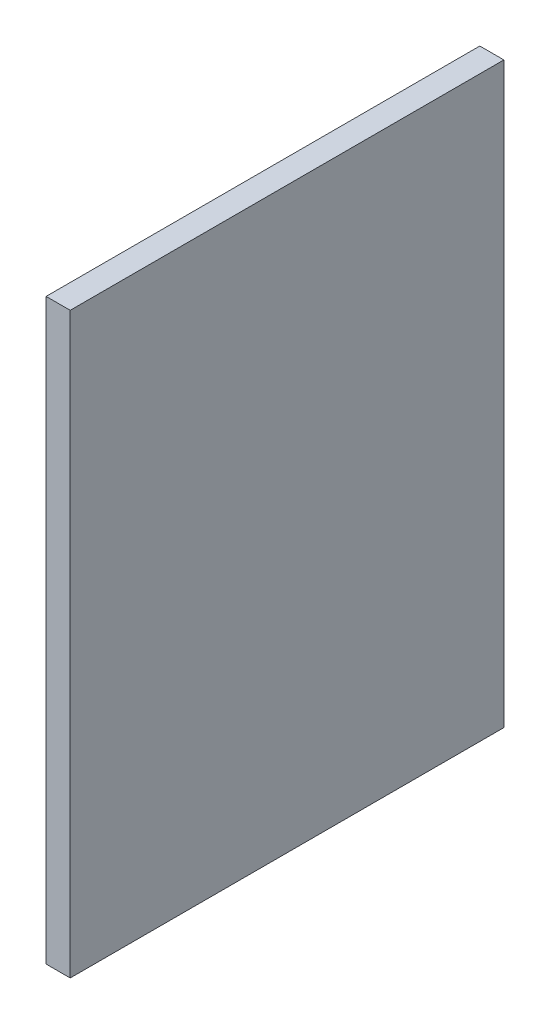
ISO-10303-21;
HEADER;
FILE_DESCRIPTION(('STEP AP214'),'2;1');
FILE_NAME('part.step','',(''),(''),'','','');
FILE_SCHEMA(('AUTOMOTIVE_DESIGN { 1 0 10303 214 1 1 1 1 }'));
ENDSEC;
DATA;
#1=APPLICATION_CONTEXT('core data for automotive mechanical design processes');
#2=APPLICATION_PROTOCOL_DEFINITION('international standard','automotive_design',2000,#1);
#3=PRODUCT_CONTEXT('',#1,'mechanical');
#4=PRODUCT('Part','Part','',(#3));
#5=PRODUCT_RELATED_PRODUCT_CATEGORY('part','',(#4));
#6=PRODUCT_DEFINITION_FORMATION('','',#4);
#7=PRODUCT_DEFINITION_CONTEXT('part definition',#1,'design');
#8=PRODUCT_DEFINITION('design','',#6,#7);
#9=PRODUCT_DEFINITION_SHAPE('','',#8);
#10=(LENGTH_UNIT() NAMED_UNIT(*) SI_UNIT(.MILLI.,.METRE.));
#11=(NAMED_UNIT(*) PLANE_ANGLE_UNIT() SI_UNIT($,.RADIAN.));
#12=(NAMED_UNIT(*) SI_UNIT($,.STERADIAN.) SOLID_ANGLE_UNIT());
#13=UNCERTAINTY_MEASURE_WITH_UNIT(LENGTH_MEASURE(1.E-05),#10,'distance_accuracy_value','');
#14=(GEOMETRIC_REPRESENTATION_CONTEXT(3) GLOBAL_UNCERTAINTY_ASSIGNED_CONTEXT((#13)) GLOBAL_UNIT_ASSIGNED_CONTEXT((#10,
#11,#12)) REPRESENTATION_CONTEXT('',''));
#15=CARTESIAN_POINT('',(0.,0.,0.));
#16=DIRECTION('',(0.,0.,1.));
#17=DIRECTION('',(1.,0.,0.));
#18=AXIS2_PLACEMENT_3D('',#15,#16,#17);
#19=CARTESIAN_POINT('',(1.5875,38.1,28.575));
#20=DIRECTION('',(0.,0.,-1.));
#21=DIRECTION('',(0.,1.,0.));
#22=AXIS2_PLACEMENT_3D('',#19,#20,#21);
#23=PLANE('',#22);
#24=DIRECTION('',(0.,-1.,0.));
#25=VECTOR('',#24,1.);
#26=CARTESIAN_POINT('',(-1.5875,38.1,28.575));
#27=LINE('',#26,#25);
#28=CARTESIAN_POINT('',(-1.5875,38.1,28.575));
#29=VERTEX_POINT('',#28);
#30=CARTESIAN_POINT('',(-1.5875,-38.1,28.575));
#31=VERTEX_POINT('',#30);
#32=EDGE_CURVE('E114',#29,#31,#27,.T.);
#33=ORIENTED_EDGE('',*,*,#32,.T.);
#34=DIRECTION('',(-1.,0.,0.));
#35=VECTOR('',#34,1.);
#36=CARTESIAN_POINT('',(1.5875,-38.1,28.575));
#37=LINE('',#36,#35);
#38=CARTESIAN_POINT('',(1.5875,-38.1,28.575));
#39=VERTEX_POINT('',#38);
#40=EDGE_CURVE('E11',#39,#31,#37,.T.);
#41=ORIENTED_EDGE('',*,*,#40,.F.);
#42=DIRECTION('',(0.,-1.,0.));
#43=VECTOR('',#42,1.);
#44=CARTESIAN_POINT('',(1.5875,38.1,28.575));
#45=LINE('',#44,#43);
#46=CARTESIAN_POINT('',(1.5875,38.1,28.575));
#47=VERTEX_POINT('',#46);
#48=EDGE_CURVE('E96',#47,#39,#45,.T.);
#49=ORIENTED_EDGE('',*,*,#48,.F.);
#50=DIRECTION('',(-1.,0.,0.));
#51=VECTOR('',#50,1.);
#52=CARTESIAN_POINT('',(1.5875,38.1,28.575));
#53=LINE('',#52,#51);
#54=EDGE_CURVE('E110',#47,#29,#53,.T.);
#55=ORIENTED_EDGE('',*,*,#54,.T.);
#56=EDGE_LOOP('',(#33,#41,#49,#55));
#57=FACE_BOUND('',#56,.T.);
#58=ADVANCED_FACE('F41',(#57),#23,.F.);
#59=CARTESIAN_POINT('',(1.5875,-38.1,-28.575));
#60=DIRECTION('',(0.,1.,0.));
#61=DIRECTION('',(0.,0.,1.));
#62=AXIS2_PLACEMENT_3D('',#59,#60,#61);
#63=PLANE('',#62);
#64=DIRECTION('',(0.,0.,-1.));
#65=VECTOR('',#64,1.);
#66=CARTESIAN_POINT('',(-1.5875,-38.1,-28.575));
#67=LINE('',#66,#65);
#68=CARTESIAN_POINT('',(-1.5875,-38.1,-28.575));
#69=VERTEX_POINT('',#68);
#70=EDGE_CURVE('E101',#31,#69,#67,.T.);
#71=ORIENTED_EDGE('',*,*,#70,.T.);
#72=DIRECTION('',(-1.,0.,0.));
#73=VECTOR('',#72,1.);
#74=CARTESIAN_POINT('',(1.5875,-38.1,-28.575));
#75=LINE('',#74,#73);
#76=CARTESIAN_POINT('',(1.5875,-38.1,-28.575));
#77=VERTEX_POINT('',#76);
#78=EDGE_CURVE('E49',#77,#69,#75,.T.);
#79=ORIENTED_EDGE('',*,*,#78,.F.);
#80=DIRECTION('',(0.,0.,-1.));
#81=VECTOR('',#80,1.);
#82=CARTESIAN_POINT('',(1.5875,-38.1,-28.575));
#83=LINE('',#82,#81);
#84=EDGE_CURVE('E90',#39,#77,#83,.T.);
#85=ORIENTED_EDGE('',*,*,#84,.F.);
#86=ORIENTED_EDGE('',*,*,#40,.T.);
#87=EDGE_LOOP('',(#71,#79,#85,#86));
#88=FACE_BOUND('',#87,.T.);
#89=ADVANCED_FACE('F100',(#88),#63,.F.);
#90=CARTESIAN_POINT('',(1.5875,38.1,-28.575));
#91=DIRECTION('',(0.,0.,1.));
#92=DIRECTION('',(0.,-1.,0.));
#93=AXIS2_PLACEMENT_3D('',#90,#91,#92);
#94=PLANE('',#93);
#95=DIRECTION('',(0.,1.,0.));
#96=VECTOR('',#95,1.);
#97=CARTESIAN_POINT('',(-1.5875,38.1,-28.575));
#98=LINE('',#97,#96);
#99=CARTESIAN_POINT('',(-1.5875,38.1,-28.575));
#100=VERTEX_POINT('',#99);
#101=EDGE_CURVE('E77',#69,#100,#98,.T.);
#102=ORIENTED_EDGE('',*,*,#101,.T.);
#103=DIRECTION('',(-1.,0.,0.));
#104=VECTOR('',#103,1.);
#105=CARTESIAN_POINT('',(1.5875,38.1,-28.575));
#106=LINE('',#105,#104);
#107=CARTESIAN_POINT('',(1.5875,38.1,-28.575));
#108=VERTEX_POINT('',#107);
#109=EDGE_CURVE('E103',#108,#100,#106,.T.);
#110=ORIENTED_EDGE('',*,*,#109,.F.);
#111=DIRECTION('',(0.,1.,0.));
#112=VECTOR('',#111,1.);
#113=CARTESIAN_POINT('',(1.5875,38.1,-28.575));
#114=LINE('',#113,#112);
#115=EDGE_CURVE('E94',#77,#108,#114,.T.);
#116=ORIENTED_EDGE('',*,*,#115,.F.);
#117=ORIENTED_EDGE('',*,*,#78,.T.);
#118=EDGE_LOOP('',(#102,#110,#116,#117));
#119=FACE_BOUND('',#118,.T.);
#120=ADVANCED_FACE('F104',(#119),#94,.F.);
#121=CARTESIAN_POINT('',(1.5875,38.1,-28.575));
#122=DIRECTION('',(0.,-1.,0.));
#123=DIRECTION('',(0.,0.,-1.));
#124=AXIS2_PLACEMENT_3D('',#121,#122,#123);
#125=PLANE('',#124);
#126=DIRECTION('',(0.,0.,1.));
#127=VECTOR('',#126,1.);
#128=CARTESIAN_POINT('',(-1.5875,38.1,-28.575));
#129=LINE('',#128,#127);
#130=EDGE_CURVE('E83',#100,#29,#129,.T.);
#131=ORIENTED_EDGE('',*,*,#130,.T.);
#132=ORIENTED_EDGE('',*,*,#54,.F.);
#133=DIRECTION('',(0.,0.,1.));
#134=VECTOR('',#133,1.);
#135=CARTESIAN_POINT('',(1.5875,38.1,-28.575));
#136=LINE('',#135,#134);
#137=EDGE_CURVE('E57',#108,#47,#136,.T.);
#138=ORIENTED_EDGE('',*,*,#137,.F.);
#139=ORIENTED_EDGE('',*,*,#109,.T.);
#140=EDGE_LOOP('',(#131,#132,#138,#139));
#141=FACE_BOUND('',#140,.T.);
#142=ADVANCED_FACE('F123',(#141),#125,.F.);
#143=CARTESIAN_POINT('',(1.5875,-38.1,28.575));
#144=DIRECTION('',(-1.,0.,0.));
#145=DIRECTION('',(0.,0.,1.));
#146=AXIS2_PLACEMENT_3D('',#143,#144,#145);
#147=PLANE('',#146);
#148=ORIENTED_EDGE('',*,*,#48,.T.);
#149=ORIENTED_EDGE('',*,*,#84,.T.);
#150=ORIENTED_EDGE('',*,*,#115,.T.);
#151=ORIENTED_EDGE('',*,*,#137,.T.);
#152=EDGE_LOOP('',(#148,#149,#150,#151));
#153=FACE_BOUND('',#152,.T.);
#154=ADVANCED_FACE('F92',(#153),#147,.F.);
#155=CARTESIAN_POINT('',(-1.5875,-38.1,28.575));
#156=DIRECTION('',(-1.,0.,0.));
#157=DIRECTION('',(0.,0.,1.));
#158=AXIS2_PLACEMENT_3D('',#155,#156,#157);
#159=PLANE('',#158);
#160=ORIENTED_EDGE('',*,*,#32,.F.);
#161=ORIENTED_EDGE('',*,*,#130,.F.);
#162=ORIENTED_EDGE('',*,*,#101,.F.);
#163=ORIENTED_EDGE('',*,*,#70,.F.);
#164=EDGE_LOOP('',(#160,#161,#162,#163));
#165=FACE_BOUND('',#164,.T.);
#166=ADVANCED_FACE('F126',(#165),#159,.T.);
#167=CLOSED_SHELL('',(#58,#89,#120,#142,#154,#166));
#168=MANIFOLD_SOLID_BREP('B2',#167);
#169=ADVANCED_BREP_SHAPE_REPRESENTATION('',(#18,#168),#14);
#170=SHAPE_DEFINITION_REPRESENTATION(#9,#169);
ENDSEC;
END-ISO-10303-21;
